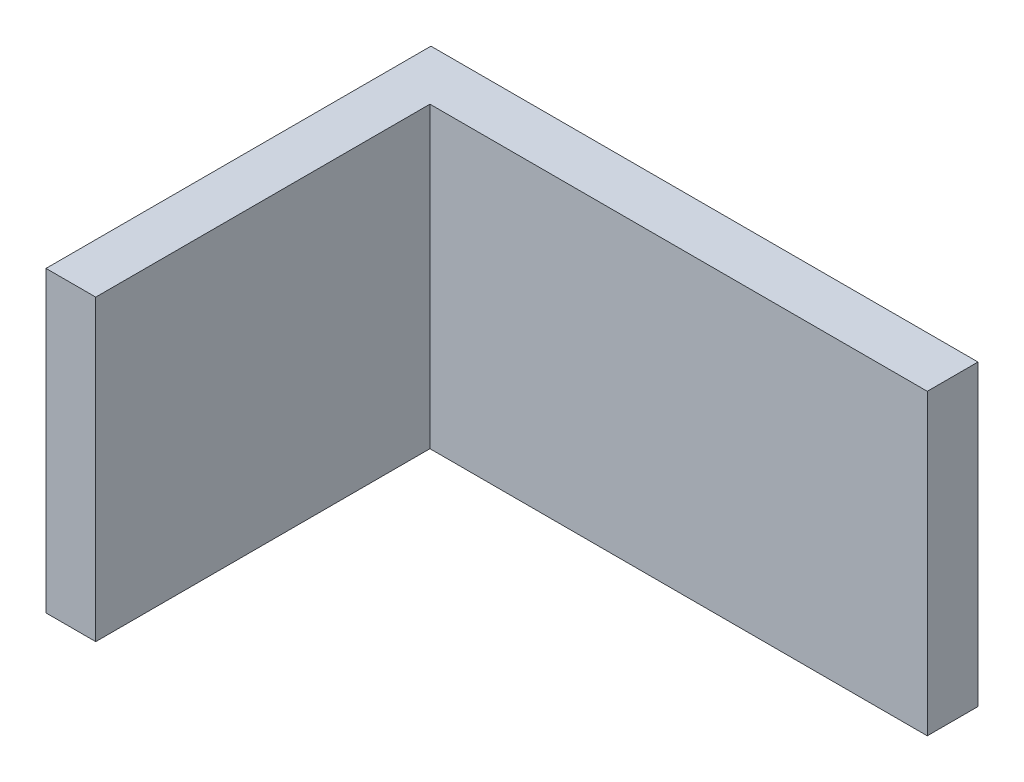
ISO-10303-21;
HEADER;
FILE_DESCRIPTION(('STEP AP214'),'2;1');
FILE_NAME('part.step','',(''),(''),'','','');
FILE_SCHEMA(('AUTOMOTIVE_DESIGN { 1 0 10303 214 1 1 1 1 }'));
ENDSEC;
DATA;
#1=APPLICATION_CONTEXT('core data for automotive mechanical design processes');
#2=APPLICATION_PROTOCOL_DEFINITION('international standard','automotive_design',2000,#1);
#3=PRODUCT_CONTEXT('',#1,'mechanical');
#4=PRODUCT('Part','Part','',(#3));
#5=PRODUCT_RELATED_PRODUCT_CATEGORY('part','',(#4));
#6=PRODUCT_DEFINITION_FORMATION('','',#4);
#7=PRODUCT_DEFINITION_CONTEXT('part definition',#1,'design');
#8=PRODUCT_DEFINITION('design','',#6,#7);
#9=PRODUCT_DEFINITION_SHAPE('','',#8);
#10=(LENGTH_UNIT() NAMED_UNIT(*) SI_UNIT(.MILLI.,.METRE.));
#11=(NAMED_UNIT(*) PLANE_ANGLE_UNIT() SI_UNIT($,.RADIAN.));
#12=(NAMED_UNIT(*) SI_UNIT($,.STERADIAN.) SOLID_ANGLE_UNIT());
#13=UNCERTAINTY_MEASURE_WITH_UNIT(LENGTH_MEASURE(1.E-05),#10,'distance_accuracy_value','');
#14=(GEOMETRIC_REPRESENTATION_CONTEXT(3) GLOBAL_UNCERTAINTY_ASSIGNED_CONTEXT((#13)) GLOBAL_UNIT_ASSIGNED_CONTEXT((#10,
#11,#12)) REPRESENTATION_CONTEXT('',''));
#15=CARTESIAN_POINT('',(0.,0.,0.));
#16=DIRECTION('',(0.,0.,1.));
#17=DIRECTION('',(1.,0.,0.));
#18=AXIS2_PLACEMENT_3D('',#15,#16,#17);
#19=CARTESIAN_POINT('',(-4.55,2.6,0.));
#20=DIRECTION('',(0.,-1.,0.));
#21=DIRECTION('',(0.,0.,1.));
#22=AXIS2_PLACEMENT_3D('',#19,#20,#21);
#23=PLANE('',#22);
#24=DIRECTION('',(-1.,0.,0.));
#25=VECTOR('',#24,1.);
#26=CARTESIAN_POINT('',(-4.,2.6,0.));
#27=LINE('',#26,#25);
#28=CARTESIAN_POINT('',(-4.,2.6,0.));
#29=VERTEX_POINT('',#28);
#30=CARTESIAN_POINT('',(-4.55,2.6,0.));
#31=VERTEX_POINT('',#30);
#32=EDGE_CURVE('E11',#29,#31,#27,.T.);
#33=ORIENTED_EDGE('',*,*,#32,.F.);
#34=DIRECTION('',(0.,0.,-1.));
#35=VECTOR('',#34,1.);
#36=CARTESIAN_POINT('',(-4.,2.6,0.051));
#37=LINE('',#36,#35);
#38=CARTESIAN_POINT('',(-4.,2.6,0.051));
#39=VERTEX_POINT('',#38);
#40=EDGE_CURVE('E24',#39,#29,#37,.T.);
#41=ORIENTED_EDGE('',*,*,#40,.F.);
#42=DIRECTION('',(1.,0.,0.));
#43=VECTOR('',#42,1.);
#44=CARTESIAN_POINT('',(-4.5,2.6,0.051));
#45=LINE('',#44,#43);
#46=CARTESIAN_POINT('',(-4.5,2.6,0.051));
#47=VERTEX_POINT('',#46);
#48=EDGE_CURVE('E87',#47,#39,#45,.T.);
#49=ORIENTED_EDGE('',*,*,#48,.F.);
#50=DIRECTION('',(0.,0.,-1.));
#51=VECTOR('',#50,1.);
#52=CARTESIAN_POINT('',(-4.5,2.6,0.387));
#53=LINE('',#52,#51);
#54=CARTESIAN_POINT('',(-4.5,2.6,0.387));
#55=VERTEX_POINT('',#54);
#56=EDGE_CURVE('E114',#55,#47,#53,.T.);
#57=ORIENTED_EDGE('',*,*,#56,.F.);
#58=DIRECTION('',(1.,0.,0.));
#59=VECTOR('',#58,1.);
#60=CARTESIAN_POINT('',(-4.55,2.6,0.387));
#61=LINE('',#60,#59);
#62=CARTESIAN_POINT('',(-4.55,2.6,0.387));
#63=VERTEX_POINT('',#62);
#64=EDGE_CURVE('E111',#63,#55,#61,.T.);
#65=ORIENTED_EDGE('',*,*,#64,.F.);
#66=DIRECTION('',(0.,0.,1.));
#67=VECTOR('',#66,1.);
#68=CARTESIAN_POINT('',(-4.55,2.6,0.));
#69=LINE('',#68,#67);
#70=EDGE_CURVE('E108',#31,#63,#69,.T.);
#71=ORIENTED_EDGE('',*,*,#70,.F.);
#72=EDGE_LOOP('',(#33,#41,#49,#57,#65,#71));
#73=FACE_BOUND('',#72,.T.);
#74=ADVANCED_FACE('F17',(#73),#23,.T.);
#75=CARTESIAN_POINT('',(-4.,2.9,0.));
#76=DIRECTION('',(0.,1.,0.));
#77=DIRECTION('',(0.,0.,1.));
#78=AXIS2_PLACEMENT_3D('',#75,#76,#77);
#79=PLANE('',#78);
#80=DIRECTION('',(1.,0.,0.));
#81=VECTOR('',#80,1.);
#82=CARTESIAN_POINT('',(-4.55,2.9,0.));
#83=LINE('',#82,#81);
#84=CARTESIAN_POINT('',(-4.55,2.9,0.));
#85=VERTEX_POINT('',#84);
#86=CARTESIAN_POINT('',(-4.,2.9,0.));
#87=VERTEX_POINT('',#86);
#88=EDGE_CURVE('E106',#85,#87,#83,.T.);
#89=ORIENTED_EDGE('',*,*,#88,.F.);
#90=DIRECTION('',(0.,0.,-1.));
#91=VECTOR('',#90,1.);
#92=CARTESIAN_POINT('',(-4.55,2.9,0.387));
#93=LINE('',#92,#91);
#94=CARTESIAN_POINT('',(-4.55,2.9,0.387));
#95=VERTEX_POINT('',#94);
#96=EDGE_CURVE('E103',#95,#85,#93,.T.);
#97=ORIENTED_EDGE('',*,*,#96,.F.);
#98=DIRECTION('',(-1.,0.,0.));
#99=VECTOR('',#98,1.);
#100=CARTESIAN_POINT('',(-4.5,2.9,0.387));
#101=LINE('',#100,#99);
#102=CARTESIAN_POINT('',(-4.5,2.9,0.387));
#103=VERTEX_POINT('',#102);
#104=EDGE_CURVE('E100',#103,#95,#101,.T.);
#105=ORIENTED_EDGE('',*,*,#104,.F.);
#106=DIRECTION('',(0.,0.,1.));
#107=VECTOR('',#106,1.);
#108=CARTESIAN_POINT('',(-4.5,2.9,0.051));
#109=LINE('',#108,#107);
#110=CARTESIAN_POINT('',(-4.5,2.9,0.051));
#111=VERTEX_POINT('',#110);
#112=EDGE_CURVE('E72',#111,#103,#109,.T.);
#113=ORIENTED_EDGE('',*,*,#112,.F.);
#114=DIRECTION('',(-1.,0.,0.));
#115=VECTOR('',#114,1.);
#116=CARTESIAN_POINT('',(-4.,2.9,0.051));
#117=LINE('',#116,#115);
#118=CARTESIAN_POINT('',(-4.,2.9,0.051));
#119=VERTEX_POINT('',#118);
#120=EDGE_CURVE('E66',#119,#111,#117,.T.);
#121=ORIENTED_EDGE('',*,*,#120,.F.);
#122=DIRECTION('',(0.,0.,1.));
#123=VECTOR('',#122,1.);
#124=CARTESIAN_POINT('',(-4.,2.9,0.));
#125=LINE('',#124,#123);
#126=EDGE_CURVE('E69',#87,#119,#125,.T.);
#127=ORIENTED_EDGE('',*,*,#126,.F.);
#128=EDGE_LOOP('',(#89,#97,#105,#113,#121,#127));
#129=FACE_BOUND('',#128,.T.);
#130=ADVANCED_FACE('F68',(#129),#79,.T.);
#131=CARTESIAN_POINT('',(-4.55,2.6,0.387));
#132=DIRECTION('',(0.,0.,1.));
#133=DIRECTION('',(0.,1.,0.));
#134=AXIS2_PLACEMENT_3D('',#131,#132,#133);
#135=PLANE('',#134);
#136=ORIENTED_EDGE('',*,*,#64,.T.);
#137=DIRECTION('',(0.,-1.,0.));
#138=VECTOR('',#137,1.);
#139=CARTESIAN_POINT('',(-4.5,2.9,0.387));
#140=LINE('',#139,#138);
#141=EDGE_CURVE('E83',#103,#55,#140,.T.);
#142=ORIENTED_EDGE('',*,*,#141,.F.);
#143=ORIENTED_EDGE('',*,*,#104,.T.);
#144=DIRECTION('',(0.,1.,0.));
#145=VECTOR('',#144,1.);
#146=CARTESIAN_POINT('',(-4.55,2.6,0.387));
#147=LINE('',#146,#145);
#148=EDGE_CURVE('E88',#63,#95,#147,.T.);
#149=ORIENTED_EDGE('',*,*,#148,.F.);
#150=EDGE_LOOP('',(#136,#142,#143,#149));
#151=FACE_BOUND('',#150,.T.);
#152=ADVANCED_FACE('F125',(#151),#135,.T.);
#153=CARTESIAN_POINT('',(-4.5,2.6,0.051));
#154=DIRECTION('',(0.,0.,1.));
#155=DIRECTION('',(0.,1.,0.));
#156=AXIS2_PLACEMENT_3D('',#153,#154,#155);
#157=PLANE('',#156);
#158=ORIENTED_EDGE('',*,*,#48,.T.);
#159=DIRECTION('',(0.,-1.,0.));
#160=VECTOR('',#159,1.);
#161=CARTESIAN_POINT('',(-4.,2.9,0.051));
#162=LINE('',#161,#160);
#163=EDGE_CURVE('E81',#119,#39,#162,.T.);
#164=ORIENTED_EDGE('',*,*,#163,.F.);
#165=ORIENTED_EDGE('',*,*,#120,.T.);
#166=DIRECTION('',(0.,1.,0.));
#167=VECTOR('',#166,1.);
#168=CARTESIAN_POINT('',(-4.5,2.6,0.051));
#169=LINE('',#168,#167);
#170=EDGE_CURVE('E89',#47,#111,#169,.T.);
#171=ORIENTED_EDGE('',*,*,#170,.F.);
#172=EDGE_LOOP('',(#158,#164,#165,#171));
#173=FACE_BOUND('',#172,.T.);
#174=ADVANCED_FACE('F86',(#173),#157,.T.);
#175=CARTESIAN_POINT('',(-4.55,2.9,0.));
#176=DIRECTION('',(-1.,0.,0.));
#177=DIRECTION('',(0.,0.,1.));
#178=AXIS2_PLACEMENT_3D('',#175,#176,#177);
#179=PLANE('',#178);
#180=DIRECTION('',(0.,1.,0.));
#181=VECTOR('',#180,1.);
#182=CARTESIAN_POINT('',(-4.55,2.6,0.));
#183=LINE('',#182,#181);
#184=EDGE_CURVE('E93',#31,#85,#183,.T.);
#185=ORIENTED_EDGE('',*,*,#184,.F.);
#186=ORIENTED_EDGE('',*,*,#70,.T.);
#187=ORIENTED_EDGE('',*,*,#148,.T.);
#188=ORIENTED_EDGE('',*,*,#96,.T.);
#189=EDGE_LOOP('',(#185,#186,#187,#188));
#190=FACE_BOUND('',#189,.T.);
#191=ADVANCED_FACE('F121',(#190),#179,.T.);
#192=CARTESIAN_POINT('',(-4.,2.6,0.));
#193=DIRECTION('',(1.,0.,0.));
#194=DIRECTION('',(0.,0.,1.));
#195=AXIS2_PLACEMENT_3D('',#192,#193,#194);
#196=PLANE('',#195);
#197=DIRECTION('',(0.,-1.,0.));
#198=VECTOR('',#197,1.);
#199=CARTESIAN_POINT('',(-4.,2.9,0.));
#200=LINE('',#199,#198);
#201=EDGE_CURVE('E82',#87,#29,#200,.T.);
#202=ORIENTED_EDGE('',*,*,#201,.F.);
#203=ORIENTED_EDGE('',*,*,#126,.T.);
#204=ORIENTED_EDGE('',*,*,#163,.T.);
#205=ORIENTED_EDGE('',*,*,#40,.T.);
#206=EDGE_LOOP('',(#202,#203,#204,#205));
#207=FACE_BOUND('',#206,.T.);
#208=ADVANCED_FACE('F80',(#207),#196,.T.);
#209=CARTESIAN_POINT('',(-4.5,2.6,0.051));
#210=DIRECTION('',(1.,0.,0.));
#211=DIRECTION('',(0.,0.,1.));
#212=AXIS2_PLACEMENT_3D('',#209,#210,#211);
#213=PLANE('',#212);
#214=ORIENTED_EDGE('',*,*,#170,.T.);
#215=ORIENTED_EDGE('',*,*,#112,.T.);
#216=ORIENTED_EDGE('',*,*,#141,.T.);
#217=ORIENTED_EDGE('',*,*,#56,.T.);
#218=EDGE_LOOP('',(#214,#215,#216,#217));
#219=FACE_BOUND('',#218,.T.);
#220=ADVANCED_FACE('F127',(#219),#213,.T.);
#221=CARTESIAN_POINT('',(-4.55,2.9,0.));
#222=DIRECTION('',(0.,0.,-1.));
#223=DIRECTION('',(0.,1.,0.));
#224=AXIS2_PLACEMENT_3D('',#221,#222,#223);
#225=PLANE('',#224);
#226=ORIENTED_EDGE('',*,*,#88,.T.);
#227=ORIENTED_EDGE('',*,*,#201,.T.);
#228=ORIENTED_EDGE('',*,*,#32,.T.);
#229=ORIENTED_EDGE('',*,*,#184,.T.);
#230=EDGE_LOOP('',(#226,#227,#228,#229));
#231=FACE_BOUND('',#230,.T.);
#232=ADVANCED_FACE('F117',(#231),#225,.T.);
#233=CLOSED_SHELL('',(#74,#130,#152,#174,#191,#208,#220,#232));
#234=MANIFOLD_SOLID_BREP('B1',#233);
#235=ADVANCED_BREP_SHAPE_REPRESENTATION('',(#18,#234),#14);
#236=SHAPE_DEFINITION_REPRESENTATION(#9,#235);
ENDSEC;
END-ISO-10303-21;
